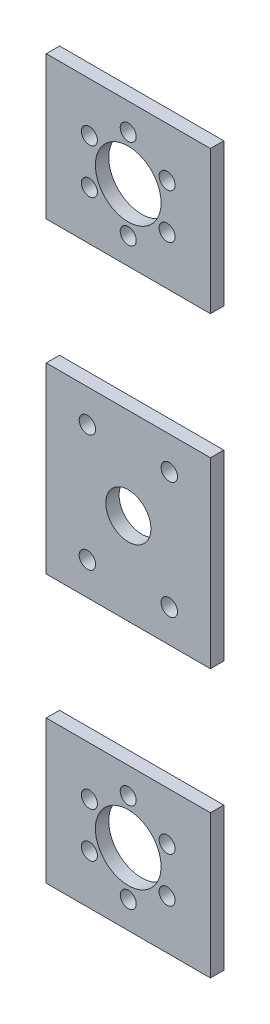
ISO-10303-21;
HEADER;
FILE_DESCRIPTION(('STEP AP214'),'2;1');
FILE_NAME('part.step','',(''),(''),'','','');
FILE_SCHEMA(('AUTOMOTIVE_DESIGN { 1 0 10303 214 1 1 1 1 }'));
ENDSEC;
DATA;
#1=APPLICATION_CONTEXT('core data for automotive mechanical design processes');
#2=APPLICATION_PROTOCOL_DEFINITION('international standard','automotive_design',2000,#1);
#3=PRODUCT_CONTEXT('',#1,'mechanical');
#4=PRODUCT('Part','Part','',(#3));
#5=PRODUCT_RELATED_PRODUCT_CATEGORY('part','',(#4));
#6=PRODUCT_DEFINITION_FORMATION('','',#4);
#7=PRODUCT_DEFINITION_CONTEXT('part definition',#1,'design');
#8=PRODUCT_DEFINITION('design','',#6,#7);
#9=PRODUCT_DEFINITION_SHAPE('','',#8);
#10=(LENGTH_UNIT() NAMED_UNIT(*) SI_UNIT(.MILLI.,.METRE.));
#11=(NAMED_UNIT(*) PLANE_ANGLE_UNIT() SI_UNIT($,.RADIAN.));
#12=(NAMED_UNIT(*) SI_UNIT($,.STERADIAN.) SOLID_ANGLE_UNIT());
#13=UNCERTAINTY_MEASURE_WITH_UNIT(LENGTH_MEASURE(1.E-05),#10,'distance_accuracy_value','');
#14=(GEOMETRIC_REPRESENTATION_CONTEXT(3) GLOBAL_UNCERTAINTY_ASSIGNED_CONTEXT((#13)) GLOBAL_UNIT_ASSIGNED_CONTEXT((#10,
#11,#12)) REPRESENTATION_CONTEXT('',''));
#15=CARTESIAN_POINT('',(0.,0.,0.));
#16=DIRECTION('',(0.,0.,1.));
#17=DIRECTION('',(1.,0.,0.));
#18=AXIS2_PLACEMENT_3D('',#15,#16,#17);
#19=CARTESIAN_POINT('',(40.,175.,6.5));
#20=DIRECTION('',(-1.,0.,0.));
#21=DIRECTION('',(0.,0.,1.));
#22=AXIS2_PLACEMENT_3D('',#19,#20,#21);
#23=PLANE('',#22);
#24=DIRECTION('',(0.,0.,1.));
#25=VECTOR('',#24,1.);
#26=CARTESIAN_POINT('',(40.,105.285938424401,6.5));
#27=LINE('',#26,#25);
#28=CARTESIAN_POINT('',(40.,105.285938424401,0.));
#29=VERTEX_POINT('',#28);
#30=CARTESIAN_POINT('',(40.,105.285938424401,6.5));
#31=VERTEX_POINT('',#30);
#32=EDGE_CURVE('E86',#29,#31,#27,.T.);
#33=ORIENTED_EDGE('',*,*,#32,.F.);
#34=DIRECTION('',(0.,1.,0.));
#35=VECTOR('',#34,1.);
#36=CARTESIAN_POINT('',(40.,175.,0.));
#37=LINE('',#36,#35);
#38=CARTESIAN_POINT('',(40.,175.,0.));
#39=VERTEX_POINT('',#38);
#40=EDGE_CURVE('E104',#29,#39,#37,.T.);
#41=ORIENTED_EDGE('',*,*,#40,.T.);
#42=DIRECTION('',(0.,0.,-1.));
#43=VECTOR('',#42,1.);
#44=CARTESIAN_POINT('',(40.,175.,6.5));
#45=LINE('',#44,#43);
#46=CARTESIAN_POINT('',(40.,175.,6.5));
#47=VERTEX_POINT('',#46);
#48=EDGE_CURVE('E115',#47,#39,#45,.T.);
#49=ORIENTED_EDGE('',*,*,#48,.F.);
#50=DIRECTION('',(0.,1.,0.));
#51=VECTOR('',#50,1.);
#52=CARTESIAN_POINT('',(40.,175.,6.5));
#53=LINE('',#52,#51);
#54=EDGE_CURVE('E108',#31,#47,#53,.T.);
#55=ORIENTED_EDGE('',*,*,#54,.F.);
#56=EDGE_LOOP('',(#33,#41,#49,#55));
#57=FACE_BOUND('',#56,.T.);
#58=ADVANCED_FACE('F61',(#57),#23,.F.);
#59=CARTESIAN_POINT('',(-40.,175.,6.5));
#60=DIRECTION('',(1.,0.,0.));
#61=DIRECTION('',(0.,1.,0.));
#62=AXIS2_PLACEMENT_3D('',#59,#60,#61);
#63=PLANE('',#62);
#64=DIRECTION('',(0.,0.,-1.));
#65=VECTOR('',#64,1.);
#66=CARTESIAN_POINT('',(-40.,105.285938424401,6.5));
#67=LINE('',#66,#65);
#68=CARTESIAN_POINT('',(-40.,105.285938424401,6.5));
#69=VERTEX_POINT('',#68);
#70=CARTESIAN_POINT('',(-40.,105.285938424401,0.));
#71=VERTEX_POINT('',#70);
#72=EDGE_CURVE('E70',#69,#71,#67,.T.);
#73=ORIENTED_EDGE('',*,*,#72,.F.);
#74=DIRECTION('',(0.,-1.,0.));
#75=VECTOR('',#74,1.);
#76=CARTESIAN_POINT('',(-40.,175.,6.5));
#77=LINE('',#76,#75);
#78=CARTESIAN_POINT('',(-40.,175.,6.5));
#79=VERTEX_POINT('',#78);
#80=EDGE_CURVE('E64',#79,#69,#77,.T.);
#81=ORIENTED_EDGE('',*,*,#80,.F.);
#82=DIRECTION('',(0.,0.,-1.));
#83=VECTOR('',#82,1.);
#84=CARTESIAN_POINT('',(-40.,175.,6.5));
#85=LINE('',#84,#83);
#86=CARTESIAN_POINT('',(-40.,175.,0.));
#87=VERTEX_POINT('',#86);
#88=EDGE_CURVE('E116',#79,#87,#85,.T.);
#89=ORIENTED_EDGE('',*,*,#88,.T.);
#90=DIRECTION('',(0.,-1.,0.));
#91=VECTOR('',#90,1.);
#92=CARTESIAN_POINT('',(-40.,175.,0.));
#93=LINE('',#92,#91);
#94=EDGE_CURVE('E128',#87,#71,#93,.T.);
#95=ORIENTED_EDGE('',*,*,#94,.T.);
#96=EDGE_LOOP('',(#73,#81,#89,#95));
#97=FACE_BOUND('',#96,.T.);
#98=ADVANCED_FACE('F174',(#97),#63,.F.);
#99=CARTESIAN_POINT('',(0.,0.,6.5));
#100=DIRECTION('',(0.,0.,1.));
#101=DIRECTION('',(1.,0.,0.));
#102=AXIS2_PLACEMENT_3D('',#99,#100,#101);
#103=PLANE('',#102);
#104=CARTESIAN_POINT('',(18.8924120266563,129.065015417287,6.5));
#105=DIRECTION('',(0.,0.,1.));
#106=DIRECTION('',(1.,0.,0.));
#107=AXIS2_PLACEMENT_3D('',#104,#105,#106);
#108=CIRCLE('',#107,3.90000000000003);
#109=CARTESIAN_POINT('',(22.7924120266564,129.065015417287,6.5));
#110=VERTEX_POINT('',#109);
#111=EDGE_CURVE('E145',#110,#110,#108,.T.);
#112=ORIENTED_EDGE('',*,*,#111,.F.);
#113=EDGE_LOOP('',(#112));
#114=FACE_BOUND('',#113,.T.);
#115=CARTESIAN_POINT('',(18.8924120266563,150.934984582713,6.5));
#116=DIRECTION('',(0.,0.,1.));
#117=DIRECTION('',(1.,0.,0.));
#118=AXIS2_PLACEMENT_3D('',#115,#116,#117);
#119=CIRCLE('',#118,3.89999999999999);
#120=CARTESIAN_POINT('',(22.7924120266563,150.934984582713,6.5));
#121=VERTEX_POINT('',#120);
#122=EDGE_CURVE('E148',#121,#121,#119,.T.);
#123=ORIENTED_EDGE('',*,*,#122,.F.);
#124=EDGE_LOOP('',(#123));
#125=FACE_BOUND('',#124,.T.);
#126=CARTESIAN_POINT('',(-0.0475368505847978,161.869969165426,6.5));
#127=DIRECTION('',(0.,0.,1.));
#128=DIRECTION('',(1.,0.,0.));
#129=AXIS2_PLACEMENT_3D('',#126,#127,#128);
#130=CIRCLE('',#129,3.89999999999999);
#131=CARTESIAN_POINT('',(3.8524631494152,161.869969165426,6.5));
#132=VERTEX_POINT('',#131);
#133=EDGE_CURVE('E154',#132,#132,#130,.T.);
#134=ORIENTED_EDGE('',*,*,#133,.F.);
#135=EDGE_LOOP('',(#134));
#136=FACE_BOUND('',#135,.T.);
#137=CARTESIAN_POINT('',(-18.9874857278259,150.934984582713,6.5));
#138=DIRECTION('',(0.,0.,1.));
#139=DIRECTION('',(1.,0.,0.));
#140=AXIS2_PLACEMENT_3D('',#137,#138,#139);
#141=CIRCLE('',#140,3.89999999999999);
#142=CARTESIAN_POINT('',(-15.0874857278259,150.934984582713,6.5));
#143=VERTEX_POINT('',#142);
#144=EDGE_CURVE('E133',#143,#143,#141,.T.);
#145=ORIENTED_EDGE('',*,*,#144,.F.);
#146=EDGE_LOOP('',(#145));
#147=FACE_BOUND('',#146,.T.);
#148=CARTESIAN_POINT('',(-0.0475368505847978,140.,6.5));
#149=DIRECTION('',(0.,0.,1.));
#150=DIRECTION('',(1.,0.,0.));
#151=AXIS2_PLACEMENT_3D('',#148,#149,#150);
#152=CIRCLE('',#151,16.);
#153=CARTESIAN_POINT('',(15.9524631494152,140.,6.5));
#154=VERTEX_POINT('',#153);
#155=EDGE_CURVE('E130',#154,#154,#152,.T.);
#156=ORIENTED_EDGE('',*,*,#155,.F.);
#157=EDGE_LOOP('',(#156));
#158=FACE_BOUND('',#157,.T.);
#159=CARTESIAN_POINT('',(-0.0475368505847978,118.130030834574,6.5));
#160=DIRECTION('',(0.,0.,1.));
#161=DIRECTION('',(1.,0.,0.));
#162=AXIS2_PLACEMENT_3D('',#159,#160,#161);
#163=CIRCLE('',#162,3.9);
#164=CARTESIAN_POINT('',(3.8524631494152,118.130030834574,6.5));
#165=VERTEX_POINT('',#164);
#166=EDGE_CURVE('E123',#165,#165,#163,.T.);
#167=ORIENTED_EDGE('',*,*,#166,.F.);
#168=EDGE_LOOP('',(#167));
#169=FACE_BOUND('',#168,.T.);
#170=CARTESIAN_POINT('',(-18.9874857278259,129.065015417287,6.5));
#171=DIRECTION('',(0.,0.,1.));
#172=DIRECTION('',(1.,0.,0.));
#173=AXIS2_PLACEMENT_3D('',#170,#171,#172);
#174=CIRCLE('',#173,3.89999999999999);
#175=CARTESIAN_POINT('',(-15.0874857278259,129.065015417287,6.5));
#176=VERTEX_POINT('',#175);
#177=EDGE_CURVE('E120',#176,#176,#174,.T.);
#178=ORIENTED_EDGE('',*,*,#177,.F.);
#179=EDGE_LOOP('',(#178));
#180=FACE_BOUND('',#179,.T.);
#181=ORIENTED_EDGE('',*,*,#80,.T.);
#182=DIRECTION('',(1.,0.,0.));
#183=VECTOR('',#182,1.);
#184=CARTESIAN_POINT('',(0.,105.285938424401,6.5));
#185=LINE('',#184,#183);
#186=EDGE_CURVE('E113',#69,#31,#185,.T.);
#187=ORIENTED_EDGE('',*,*,#186,.T.);
#188=ORIENTED_EDGE('',*,*,#54,.T.);
#189=DIRECTION('',(-1.,0.,0.));
#190=VECTOR('',#189,1.);
#191=CARTESIAN_POINT('',(-40.,175.,6.5));
#192=LINE('',#191,#190);
#193=EDGE_CURVE('E112',#47,#79,#192,.T.);
#194=ORIENTED_EDGE('',*,*,#193,.T.);
#195=EDGE_LOOP('',(#181,#187,#188,#194));
#196=FACE_BOUND('',#195,.T.);
#197=ADVANCED_FACE('F111',(#114,#125,#136,#147,#158,#169,#180,#196),#103,.T.);
#198=CARTESIAN_POINT('',(0.,0.,0.));
#199=DIRECTION('',(0.,0.,1.));
#200=DIRECTION('',(1.,0.,0.));
#201=AXIS2_PLACEMENT_3D('',#198,#199,#200);
#202=PLANE('',#201);
#203=CARTESIAN_POINT('',(-18.9874857278259,129.065015417287,0.));
#204=DIRECTION('',(0.,0.,1.));
#205=DIRECTION('',(1.,0.,0.));
#206=AXIS2_PLACEMENT_3D('',#203,#204,#205);
#207=CIRCLE('',#206,3.89999999999999);
#208=CARTESIAN_POINT('',(-15.0874857278259,129.065015417287,0.));
#209=VERTEX_POINT('',#208);
#210=EDGE_CURVE('E118',#209,#209,#207,.T.);
#211=ORIENTED_EDGE('',*,*,#210,.T.);
#212=EDGE_LOOP('',(#211));
#213=FACE_BOUND('',#212,.T.);
#214=CARTESIAN_POINT('',(-0.0475368505847978,118.130030834574,0.));
#215=DIRECTION('',(0.,0.,1.));
#216=DIRECTION('',(1.,0.,0.));
#217=AXIS2_PLACEMENT_3D('',#214,#215,#216);
#218=CIRCLE('',#217,3.9);
#219=CARTESIAN_POINT('',(3.8524631494152,118.130030834574,0.));
#220=VERTEX_POINT('',#219);
#221=EDGE_CURVE('E137',#220,#220,#218,.T.);
#222=ORIENTED_EDGE('',*,*,#221,.T.);
#223=EDGE_LOOP('',(#222));
#224=FACE_BOUND('',#223,.T.);
#225=CARTESIAN_POINT('',(-0.0475368505847978,140.,0.));
#226=DIRECTION('',(0.,0.,1.));
#227=DIRECTION('',(1.,0.,0.));
#228=AXIS2_PLACEMENT_3D('',#225,#226,#227);
#229=CIRCLE('',#228,16.);
#230=CARTESIAN_POINT('',(15.9524631494152,140.,0.));
#231=VERTEX_POINT('',#230);
#232=EDGE_CURVE('E134',#231,#231,#229,.T.);
#233=ORIENTED_EDGE('',*,*,#232,.T.);
#234=EDGE_LOOP('',(#233));
#235=FACE_BOUND('',#234,.T.);
#236=CARTESIAN_POINT('',(-18.9874857278259,150.934984582713,0.));
#237=DIRECTION('',(0.,0.,1.));
#238=DIRECTION('',(1.,0.,0.));
#239=AXIS2_PLACEMENT_3D('',#236,#237,#238);
#240=CIRCLE('',#239,3.89999999999999);
#241=CARTESIAN_POINT('',(-15.0874857278259,150.934984582713,0.));
#242=VERTEX_POINT('',#241);
#243=EDGE_CURVE('E136',#242,#242,#240,.T.);
#244=ORIENTED_EDGE('',*,*,#243,.T.);
#245=EDGE_LOOP('',(#244));
#246=FACE_BOUND('',#245,.T.);
#247=CARTESIAN_POINT('',(-0.0475368505847978,161.869969165426,0.));
#248=DIRECTION('',(0.,0.,1.));
#249=DIRECTION('',(1.,0.,0.));
#250=AXIS2_PLACEMENT_3D('',#247,#248,#249);
#251=CIRCLE('',#250,3.89999999999999);
#252=CARTESIAN_POINT('',(3.8524631494152,161.869969165426,0.));
#253=VERTEX_POINT('',#252);
#254=EDGE_CURVE('E157',#253,#253,#251,.T.);
#255=ORIENTED_EDGE('',*,*,#254,.T.);
#256=EDGE_LOOP('',(#255));
#257=FACE_BOUND('',#256,.T.);
#258=CARTESIAN_POINT('',(18.8924120266563,150.934984582713,0.));
#259=DIRECTION('',(0.,0.,1.));
#260=DIRECTION('',(1.,0.,0.));
#261=AXIS2_PLACEMENT_3D('',#258,#259,#260);
#262=CIRCLE('',#261,3.89999999999999);
#263=CARTESIAN_POINT('',(22.7924120266563,150.934984582713,0.));
#264=VERTEX_POINT('',#263);
#265=EDGE_CURVE('E151',#264,#264,#262,.T.);
#266=ORIENTED_EDGE('',*,*,#265,.T.);
#267=EDGE_LOOP('',(#266));
#268=FACE_BOUND('',#267,.T.);
#269=CARTESIAN_POINT('',(18.8924120266563,129.065015417287,0.));
#270=DIRECTION('',(0.,0.,1.));
#271=DIRECTION('',(1.,0.,0.));
#272=AXIS2_PLACEMENT_3D('',#269,#270,#271);
#273=CIRCLE('',#272,3.90000000000003);
#274=CARTESIAN_POINT('',(22.7924120266564,129.065015417287,0.));
#275=VERTEX_POINT('',#274);
#276=EDGE_CURVE('E125',#275,#275,#273,.T.);
#277=ORIENTED_EDGE('',*,*,#276,.T.);
#278=EDGE_LOOP('',(#277));
#279=FACE_BOUND('',#278,.T.);
#280=DIRECTION('',(1.,0.,0.));
#281=VECTOR('',#280,1.);
#282=CARTESIAN_POINT('',(0.,105.285938424401,0.));
#283=LINE('',#282,#281);
#284=EDGE_CURVE('E14',#71,#29,#283,.T.);
#285=ORIENTED_EDGE('',*,*,#284,.F.);
#286=ORIENTED_EDGE('',*,*,#94,.F.);
#287=DIRECTION('',(-1.,0.,0.));
#288=VECTOR('',#287,1.);
#289=CARTESIAN_POINT('',(-40.,175.,0.));
#290=LINE('',#289,#288);
#291=EDGE_CURVE('E95',#39,#87,#290,.T.);
#292=ORIENTED_EDGE('',*,*,#291,.F.);
#293=ORIENTED_EDGE('',*,*,#40,.F.);
#294=EDGE_LOOP('',(#285,#286,#292,#293));
#295=FACE_BOUND('',#294,.T.);
#296=ADVANCED_FACE('F177',(#213,#224,#235,#246,#257,#268,#279,#295),#202,.F.);
#297=CARTESIAN_POINT('',(-40.,175.,6.5));
#298=DIRECTION('',(0.,-1.,0.));
#299=DIRECTION('',(0.,0.,-1.));
#300=AXIS2_PLACEMENT_3D('',#297,#298,#299);
#301=PLANE('',#300);
#302=ORIENTED_EDGE('',*,*,#291,.T.);
#303=ORIENTED_EDGE('',*,*,#88,.F.);
#304=ORIENTED_EDGE('',*,*,#193,.F.);
#305=ORIENTED_EDGE('',*,*,#48,.T.);
#306=EDGE_LOOP('',(#302,#303,#304,#305));
#307=FACE_BOUND('',#306,.T.);
#308=ADVANCED_FACE('F114',(#307),#301,.F.);
#309=CARTESIAN_POINT('',(-18.9874857278259,129.065015417287,0.));
#310=DIRECTION('',(0.,0.,1.));
#311=DIRECTION('',(1.,0.,0.));
#312=AXIS2_PLACEMENT_3D('',#309,#310,#311);
#313=CYLINDRICAL_SURFACE('',#312,3.89999999999999);
#314=ORIENTED_EDGE('',*,*,#210,.F.);
#315=EDGE_LOOP('',(#314));
#316=FACE_BOUND('',#315,.T.);
#317=ORIENTED_EDGE('',*,*,#177,.T.);
#318=EDGE_LOOP('',(#317));
#319=FACE_BOUND('',#318,.T.);
#320=ADVANCED_FACE('F185',(#316,#319),#313,.F.);
#321=CARTESIAN_POINT('',(-0.0475368505847978,118.130030834574,0.));
#322=DIRECTION('',(0.,0.,1.));
#323=DIRECTION('',(1.,0.,0.));
#324=AXIS2_PLACEMENT_3D('',#321,#322,#323);
#325=CYLINDRICAL_SURFACE('',#324,3.9);
#326=ORIENTED_EDGE('',*,*,#221,.F.);
#327=EDGE_LOOP('',(#326));
#328=FACE_BOUND('',#327,.T.);
#329=ORIENTED_EDGE('',*,*,#166,.T.);
#330=EDGE_LOOP('',(#329));
#331=FACE_BOUND('',#330,.T.);
#332=ADVANCED_FACE('F220',(#328,#331),#325,.F.);
#333=CARTESIAN_POINT('',(-0.0475368505847978,140.,0.));
#334=DIRECTION('',(0.,0.,1.));
#335=DIRECTION('',(1.,0.,0.));
#336=AXIS2_PLACEMENT_3D('',#333,#334,#335);
#337=CYLINDRICAL_SURFACE('',#336,16.);
#338=ORIENTED_EDGE('',*,*,#232,.F.);
#339=EDGE_LOOP('',(#338));
#340=FACE_BOUND('',#339,.T.);
#341=ORIENTED_EDGE('',*,*,#155,.T.);
#342=EDGE_LOOP('',(#341));
#343=FACE_BOUND('',#342,.T.);
#344=ADVANCED_FACE('F230',(#340,#343),#337,.F.);
#345=CARTESIAN_POINT('',(-18.9874857278259,150.934984582713,0.));
#346=DIRECTION('',(0.,0.,1.));
#347=DIRECTION('',(1.,0.,0.));
#348=AXIS2_PLACEMENT_3D('',#345,#346,#347);
#349=CYLINDRICAL_SURFACE('',#348,3.89999999999999);
#350=ORIENTED_EDGE('',*,*,#243,.F.);
#351=EDGE_LOOP('',(#350));
#352=FACE_BOUND('',#351,.T.);
#353=ORIENTED_EDGE('',*,*,#144,.T.);
#354=EDGE_LOOP('',(#353));
#355=FACE_BOUND('',#354,.T.);
#356=ADVANCED_FACE('F240',(#352,#355),#349,.F.);
#357=CARTESIAN_POINT('',(-0.0475368505847978,161.869969165426,0.));
#358=DIRECTION('',(0.,0.,1.));
#359=DIRECTION('',(1.,0.,0.));
#360=AXIS2_PLACEMENT_3D('',#357,#358,#359);
#361=CYLINDRICAL_SURFACE('',#360,3.89999999999999);
#362=ORIENTED_EDGE('',*,*,#254,.F.);
#363=EDGE_LOOP('',(#362));
#364=FACE_BOUND('',#363,.T.);
#365=ORIENTED_EDGE('',*,*,#133,.T.);
#366=EDGE_LOOP('',(#365));
#367=FACE_BOUND('',#366,.T.);
#368=ADVANCED_FACE('F250',(#364,#367),#361,.F.);
#369=CARTESIAN_POINT('',(18.8924120266563,150.934984582713,0.));
#370=DIRECTION('',(0.,0.,1.));
#371=DIRECTION('',(1.,0.,0.));
#372=AXIS2_PLACEMENT_3D('',#369,#370,#371);
#373=CYLINDRICAL_SURFACE('',#372,3.89999999999999);
#374=ORIENTED_EDGE('',*,*,#265,.F.);
#375=EDGE_LOOP('',(#374));
#376=FACE_BOUND('',#375,.T.);
#377=ORIENTED_EDGE('',*,*,#122,.T.);
#378=EDGE_LOOP('',(#377));
#379=FACE_BOUND('',#378,.T.);
#380=ADVANCED_FACE('F260',(#376,#379),#373,.F.);
#381=CARTESIAN_POINT('',(18.8924120266563,129.065015417287,0.));
#382=DIRECTION('',(0.,0.,1.));
#383=DIRECTION('',(1.,0.,0.));
#384=AXIS2_PLACEMENT_3D('',#381,#382,#383);
#385=CYLINDRICAL_SURFACE('',#384,3.90000000000003);
#386=ORIENTED_EDGE('',*,*,#276,.F.);
#387=EDGE_LOOP('',(#386));
#388=FACE_BOUND('',#387,.T.);
#389=ORIENTED_EDGE('',*,*,#111,.T.);
#390=EDGE_LOOP('',(#389));
#391=FACE_BOUND('',#390,.T.);
#392=ADVANCED_FACE('F270',(#388,#391),#385,.F.);
#393=CARTESIAN_POINT('',(0.,105.285938424401,0.));
#394=DIRECTION('',(0.,-1.,0.));
#395=DIRECTION('',(0.,0.,-1.));
#396=AXIS2_PLACEMENT_3D('',#393,#394,#395);
#397=PLANE('',#396);
#398=ORIENTED_EDGE('',*,*,#32,.T.);
#399=ORIENTED_EDGE('',*,*,#186,.F.);
#400=ORIENTED_EDGE('',*,*,#72,.T.);
#401=ORIENTED_EDGE('',*,*,#284,.T.);
#402=EDGE_LOOP('',(#398,#399,#400,#401));
#403=FACE_BOUND('',#402,.T.);
#404=ADVANCED_FACE('F175',(#403),#397,.T.);
#405=CLOSED_SHELL('',(#58,#98,#197,#296,#308,#320,#332,#344,#356,#368,#380,#392,#404));
#406=MANIFOLD_SOLID_BREP('B2',#405);
#407=CARTESIAN_POINT('',(-40.,-175.,6.5));
#408=DIRECTION('',(0.,1.,0.));
#409=DIRECTION('',(0.,0.,1.));
#410=AXIS2_PLACEMENT_3D('',#407,#408,#409);
#411=PLANE('',#410);
#412=DIRECTION('',(1.,0.,0.));
#413=VECTOR('',#412,1.);
#414=CARTESIAN_POINT('',(-40.,-175.,0.));
#415=LINE('',#414,#413);
#416=CARTESIAN_POINT('',(-40.,-175.,0.));
#417=VERTEX_POINT('',#416);
#418=CARTESIAN_POINT('',(40.,-175.,0.));
#419=VERTEX_POINT('',#418);
#420=EDGE_CURVE('E411',#417,#419,#415,.T.);
#421=ORIENTED_EDGE('',*,*,#420,.T.);
#422=DIRECTION('',(0.,0.,-1.));
#423=VECTOR('',#422,1.);
#424=CARTESIAN_POINT('',(40.,-175.,6.5));
#425=LINE('',#424,#423);
#426=CARTESIAN_POINT('',(40.,-175.,6.5));
#427=VERTEX_POINT('',#426);
#428=EDGE_CURVE('E352',#427,#419,#425,.T.);
#429=ORIENTED_EDGE('',*,*,#428,.F.);
#430=DIRECTION('',(1.,0.,0.));
#431=VECTOR('',#430,1.);
#432=CARTESIAN_POINT('',(-40.,-175.,6.5));
#433=LINE('',#432,#431);
#434=CARTESIAN_POINT('',(-40.,-175.,6.5));
#435=VERTEX_POINT('',#434);
#436=EDGE_CURVE('E398',#435,#427,#433,.T.);
#437=ORIENTED_EDGE('',*,*,#436,.F.);
#438=DIRECTION('',(0.,0.,-1.));
#439=VECTOR('',#438,1.);
#440=CARTESIAN_POINT('',(-40.,-175.,6.5));
#441=LINE('',#440,#439);
#442=EDGE_CURVE('E396',#435,#417,#441,.T.);
#443=ORIENTED_EDGE('',*,*,#442,.T.);
#444=EDGE_LOOP('',(#421,#429,#437,#443));
#445=FACE_BOUND('',#444,.T.);
#446=ADVANCED_FACE('F342',(#445),#411,.F.);
#447=CARTESIAN_POINT('',(-18.9874857278259,-150.934984582713,0.));
#448=DIRECTION('',(0.,0.,1.));
#449=DIRECTION('',(1.,0.,0.));
#450=AXIS2_PLACEMENT_3D('',#447,#448,#449);
#451=CYLINDRICAL_SURFACE('',#450,3.89999999999999);
#452=CARTESIAN_POINT('',(-18.9874857278259,-150.934984582713,0.));
#453=DIRECTION('',(0.,0.,1.));
#454=DIRECTION('',(-1.,0.,0.));
#455=AXIS2_PLACEMENT_3D('',#452,#453,#454);
#456=CIRCLE('',#455,3.89999999999999);
#457=CARTESIAN_POINT('',(-22.8874857278259,-150.934984582713,0.));
#458=VERTEX_POINT('',#457);
#459=EDGE_CURVE('E400',#458,#458,#456,.T.);
#460=ORIENTED_EDGE('',*,*,#459,.F.);
#461=EDGE_LOOP('',(#460));
#462=FACE_BOUND('',#461,.T.);
#463=CARTESIAN_POINT('',(-18.9874857278259,-150.934984582713,6.5));
#464=DIRECTION('',(0.,0.,1.));
#465=DIRECTION('',(-1.,0.,0.));
#466=AXIS2_PLACEMENT_3D('',#463,#464,#465);
#467=CIRCLE('',#466,3.89999999999999);
#468=CARTESIAN_POINT('',(-22.8874857278259,-150.934984582713,6.5));
#469=VERTEX_POINT('',#468);
#470=EDGE_CURVE('E410',#469,#469,#467,.T.);
#471=ORIENTED_EDGE('',*,*,#470,.T.);
#472=EDGE_LOOP('',(#471));
#473=FACE_BOUND('',#472,.T.);
#474=ADVANCED_FACE('F467',(#462,#473),#451,.F.);
#475=CARTESIAN_POINT('',(-0.0475368505847978,-161.869969165426,0.));
#476=DIRECTION('',(0.,0.,1.));
#477=DIRECTION('',(1.,0.,0.));
#478=AXIS2_PLACEMENT_3D('',#475,#476,#477);
#479=CYLINDRICAL_SURFACE('',#478,3.89999999999999);
#480=CARTESIAN_POINT('',(-0.0475368505847978,-161.869969165426,0.));
#481=DIRECTION('',(0.,0.,1.));
#482=DIRECTION('',(-1.,0.,0.));
#483=AXIS2_PLACEMENT_3D('',#480,#481,#482);
#484=CIRCLE('',#483,3.89999999999999);
#485=CARTESIAN_POINT('',(-3.94753685058479,-161.869969165426,0.));
#486=VERTEX_POINT('',#485);
#487=EDGE_CURVE('E406',#486,#486,#484,.T.);
#488=ORIENTED_EDGE('',*,*,#487,.F.);
#489=EDGE_LOOP('',(#488));
#490=FACE_BOUND('',#489,.T.);
#491=CARTESIAN_POINT('',(-0.0475368505847978,-161.869969165426,6.5));
#492=DIRECTION('',(0.,0.,1.));
#493=DIRECTION('',(-1.,0.,0.));
#494=AXIS2_PLACEMENT_3D('',#491,#492,#493);
#495=CIRCLE('',#494,3.89999999999999);
#496=CARTESIAN_POINT('',(-3.94753685058479,-161.869969165426,6.5));
#497=VERTEX_POINT('',#496);
#498=EDGE_CURVE('E419',#497,#497,#495,.T.);
#499=ORIENTED_EDGE('',*,*,#498,.T.);
#500=EDGE_LOOP('',(#499));
#501=FACE_BOUND('',#500,.T.);
#502=ADVANCED_FACE('F472',(#490,#501),#479,.F.);
#503=CARTESIAN_POINT('',(-0.0475368505847978,-140.,0.));
#504=DIRECTION('',(0.,0.,1.));
#505=DIRECTION('',(1.,0.,0.));
#506=AXIS2_PLACEMENT_3D('',#503,#504,#505);
#507=CYLINDRICAL_SURFACE('',#506,16.);
#508=CARTESIAN_POINT('',(-0.0475368505847978,-140.,0.));
#509=DIRECTION('',(0.,0.,1.));
#510=DIRECTION('',(-1.,0.,0.));
#511=AXIS2_PLACEMENT_3D('',#508,#509,#510);
#512=CIRCLE('',#511,16.);
#513=CARTESIAN_POINT('',(-16.0475368505848,-140.,0.));
#514=VERTEX_POINT('',#513);
#515=EDGE_CURVE('E420',#514,#514,#512,.T.);
#516=ORIENTED_EDGE('',*,*,#515,.F.);
#517=EDGE_LOOP('',(#516));
#518=FACE_BOUND('',#517,.T.);
#519=CARTESIAN_POINT('',(-0.0475368505847978,-140.,6.5));
#520=DIRECTION('',(0.,0.,1.));
#521=DIRECTION('',(-1.,0.,0.));
#522=AXIS2_PLACEMENT_3D('',#519,#520,#521);
#523=CIRCLE('',#522,16.);
#524=CARTESIAN_POINT('',(-16.0475368505848,-140.,6.5));
#525=VERTEX_POINT('',#524);
#526=EDGE_CURVE('E415',#525,#525,#523,.T.);
#527=ORIENTED_EDGE('',*,*,#526,.T.);
#528=EDGE_LOOP('',(#527));
#529=FACE_BOUND('',#528,.T.);
#530=ADVANCED_FACE('F476',(#518,#529),#507,.F.);
#531=CARTESIAN_POINT('',(18.8924120266563,-129.065015417287,0.));
#532=DIRECTION('',(0.,0.,1.));
#533=DIRECTION('',(1.,0.,0.));
#534=AXIS2_PLACEMENT_3D('',#531,#532,#533);
#535=CYLINDRICAL_SURFACE('',#534,3.90000000000003);
#536=CARTESIAN_POINT('',(18.8924120266563,-129.065015417287,0.));
#537=DIRECTION('',(0.,0.,1.));
#538=DIRECTION('',(-1.,0.,0.));
#539=AXIS2_PLACEMENT_3D('',#536,#537,#538);
#540=CIRCLE('',#539,3.90000000000003);
#541=CARTESIAN_POINT('',(14.9924120266563,-129.065015417287,0.));
#542=VERTEX_POINT('',#541);
#543=EDGE_CURVE('E423',#542,#542,#540,.T.);
#544=ORIENTED_EDGE('',*,*,#543,.F.);
#545=EDGE_LOOP('',(#544));
#546=FACE_BOUND('',#545,.T.);
#547=CARTESIAN_POINT('',(18.8924120266563,-129.065015417287,6.5));
#548=DIRECTION('',(0.,0.,1.));
#549=DIRECTION('',(-1.,0.,0.));
#550=AXIS2_PLACEMENT_3D('',#547,#548,#549);
#551=CIRCLE('',#550,3.90000000000003);
#552=CARTESIAN_POINT('',(14.9924120266563,-129.065015417287,6.5));
#553=VERTEX_POINT('',#552);
#554=EDGE_CURVE('E418',#553,#553,#551,.T.);
#555=ORIENTED_EDGE('',*,*,#554,.T.);
#556=EDGE_LOOP('',(#555));
#557=FACE_BOUND('',#556,.T.);
#558=ADVANCED_FACE('F479',(#546,#557),#535,.F.);
#559=CARTESIAN_POINT('',(18.8924120266563,-150.934984582713,0.));
#560=DIRECTION('',(0.,0.,1.));
#561=DIRECTION('',(1.,0.,0.));
#562=AXIS2_PLACEMENT_3D('',#559,#560,#561);
#563=CYLINDRICAL_SURFACE('',#562,3.89999999999999);
#564=CARTESIAN_POINT('',(18.8924120266563,-150.934984582713,0.));
#565=DIRECTION('',(0.,0.,1.));
#566=DIRECTION('',(-1.,0.,0.));
#567=AXIS2_PLACEMENT_3D('',#564,#565,#566);
#568=CIRCLE('',#567,3.89999999999999);
#569=CARTESIAN_POINT('',(14.9924120266563,-150.934984582713,0.));
#570=VERTEX_POINT('',#569);
#571=EDGE_CURVE('E428',#570,#570,#568,.T.);
#572=ORIENTED_EDGE('',*,*,#571,.F.);
#573=EDGE_LOOP('',(#572));
#574=FACE_BOUND('',#573,.T.);
#575=CARTESIAN_POINT('',(18.8924120266563,-150.934984582713,6.5));
#576=DIRECTION('',(0.,0.,1.));
#577=DIRECTION('',(-1.,0.,0.));
#578=AXIS2_PLACEMENT_3D('',#575,#576,#577);
#579=CIRCLE('',#578,3.89999999999999);
#580=CARTESIAN_POINT('',(14.9924120266563,-150.934984582713,6.5));
#581=VERTEX_POINT('',#580);
#582=EDGE_CURVE('E424',#581,#581,#579,.T.);
#583=ORIENTED_EDGE('',*,*,#582,.T.);
#584=EDGE_LOOP('',(#583));
#585=FACE_BOUND('',#584,.T.);
#586=ADVANCED_FACE('F481',(#574,#585),#563,.F.);
#587=CARTESIAN_POINT('',(-18.9874857278259,-129.065015417287,0.));
#588=DIRECTION('',(0.,0.,1.));
#589=DIRECTION('',(1.,0.,0.));
#590=AXIS2_PLACEMENT_3D('',#587,#588,#589);
#591=CYLINDRICAL_SURFACE('',#590,3.89999999999999);
#592=CARTESIAN_POINT('',(-18.9874857278259,-129.065015417287,0.));
#593=DIRECTION('',(0.,0.,1.));
#594=DIRECTION('',(-1.,0.,0.));
#595=AXIS2_PLACEMENT_3D('',#592,#593,#594);
#596=CIRCLE('',#595,3.89999999999999);
#597=CARTESIAN_POINT('',(-22.8874857278259,-129.065015417287,0.));
#598=VERTEX_POINT('',#597);
#599=EDGE_CURVE('E431',#598,#598,#596,.T.);
#600=ORIENTED_EDGE('',*,*,#599,.F.);
#601=EDGE_LOOP('',(#600));
#602=FACE_BOUND('',#601,.T.);
#603=CARTESIAN_POINT('',(-18.9874857278259,-129.065015417287,6.5));
#604=DIRECTION('',(0.,0.,1.));
#605=DIRECTION('',(-1.,0.,0.));
#606=AXIS2_PLACEMENT_3D('',#603,#604,#605);
#607=CIRCLE('',#606,3.89999999999999);
#608=CARTESIAN_POINT('',(-22.8874857278259,-129.065015417287,6.5));
#609=VERTEX_POINT('',#608);
#610=EDGE_CURVE('E427',#609,#609,#607,.T.);
#611=ORIENTED_EDGE('',*,*,#610,.T.);
#612=EDGE_LOOP('',(#611));
#613=FACE_BOUND('',#612,.T.);
#614=ADVANCED_FACE('F484',(#602,#613),#591,.F.);
#615=CARTESIAN_POINT('',(-0.0475368505847978,-118.130030834574,0.));
#616=DIRECTION('',(0.,0.,1.));
#617=DIRECTION('',(1.,0.,0.));
#618=AXIS2_PLACEMENT_3D('',#615,#616,#617);
#619=CYLINDRICAL_SURFACE('',#618,3.9);
#620=CARTESIAN_POINT('',(-0.0475368505847978,-118.130030834574,0.));
#621=DIRECTION('',(0.,0.,1.));
#622=DIRECTION('',(-1.,0.,0.));
#623=AXIS2_PLACEMENT_3D('',#620,#621,#622);
#624=CIRCLE('',#623,3.9);
#625=CARTESIAN_POINT('',(-3.9475368505848,-118.130030834574,0.));
#626=VERTEX_POINT('',#625);
#627=EDGE_CURVE('E445',#626,#626,#624,.T.);
#628=ORIENTED_EDGE('',*,*,#627,.F.);
#629=EDGE_LOOP('',(#628));
#630=FACE_BOUND('',#629,.T.);
#631=CARTESIAN_POINT('',(-0.0475368505847978,-118.130030834574,6.5));
#632=DIRECTION('',(0.,0.,1.));
#633=DIRECTION('',(-1.,0.,0.));
#634=AXIS2_PLACEMENT_3D('',#631,#632,#633);
#635=CIRCLE('',#634,3.9);
#636=CARTESIAN_POINT('',(-3.9475368505848,-118.130030834574,6.5));
#637=VERTEX_POINT('',#636);
#638=EDGE_CURVE('E442',#637,#637,#635,.T.);
#639=ORIENTED_EDGE('',*,*,#638,.T.);
#640=EDGE_LOOP('',(#639));
#641=FACE_BOUND('',#640,.T.);
#642=ADVANCED_FACE('F492',(#630,#641),#619,.F.);
#643=CARTESIAN_POINT('',(0.,0.,0.));
#644=DIRECTION('',(0.,0.,1.));
#645=DIRECTION('',(1.,0.,0.));
#646=AXIS2_PLACEMENT_3D('',#643,#644,#645);
#647=PLANE('',#646);
#648=ORIENTED_EDGE('',*,*,#627,.T.);
#649=EDGE_LOOP('',(#648));
#650=FACE_BOUND('',#649,.T.);
#651=ORIENTED_EDGE('',*,*,#599,.T.);
#652=EDGE_LOOP('',(#651));
#653=FACE_BOUND('',#652,.T.);
#654=ORIENTED_EDGE('',*,*,#571,.T.);
#655=EDGE_LOOP('',(#654));
#656=FACE_BOUND('',#655,.T.);
#657=ORIENTED_EDGE('',*,*,#543,.T.);
#658=EDGE_LOOP('',(#657));
#659=FACE_BOUND('',#658,.T.);
#660=ORIENTED_EDGE('',*,*,#515,.T.);
#661=EDGE_LOOP('',(#660));
#662=FACE_BOUND('',#661,.T.);
#663=ORIENTED_EDGE('',*,*,#487,.T.);
#664=EDGE_LOOP('',(#663));
#665=FACE_BOUND('',#664,.T.);
#666=ORIENTED_EDGE('',*,*,#459,.T.);
#667=EDGE_LOOP('',(#666));
#668=FACE_BOUND('',#667,.T.);
#669=DIRECTION('',(0.,-1.,0.));
#670=VECTOR('',#669,1.);
#671=CARTESIAN_POINT('',(-40.,175.,0.));
#672=LINE('',#671,#670);
#673=CARTESIAN_POINT('',(-40.,-105.285938424401,0.));
#674=VERTEX_POINT('',#673);
#675=EDGE_CURVE('E385',#674,#417,#672,.T.);
#676=ORIENTED_EDGE('',*,*,#675,.F.);
#677=DIRECTION('',(1.,0.,0.));
#678=VECTOR('',#677,1.);
#679=CARTESIAN_POINT('',(0.,-105.285938424401,0.));
#680=LINE('',#679,#678);
#681=CARTESIAN_POINT('',(40.,-105.285938424401,0.));
#682=VERTEX_POINT('',#681);
#683=EDGE_CURVE('E377',#674,#682,#680,.T.);
#684=ORIENTED_EDGE('',*,*,#683,.T.);
#685=DIRECTION('',(0.,1.,0.));
#686=VECTOR('',#685,1.);
#687=CARTESIAN_POINT('',(40.,175.,0.));
#688=LINE('',#687,#686);
#689=EDGE_CURVE('E452',#419,#682,#688,.T.);
#690=ORIENTED_EDGE('',*,*,#689,.F.);
#691=ORIENTED_EDGE('',*,*,#420,.F.);
#692=EDGE_LOOP('',(#676,#684,#690,#691));
#693=FACE_BOUND('',#692,.T.);
#694=ADVANCED_FACE('F458',(#650,#653,#656,#659,#662,#665,#668,#693),#647,.F.);
#695=CARTESIAN_POINT('',(0.,0.,6.5));
#696=DIRECTION('',(0.,0.,1.));
#697=DIRECTION('',(1.,0.,0.));
#698=AXIS2_PLACEMENT_3D('',#695,#696,#697);
#699=PLANE('',#698);
#700=DIRECTION('',(1.,0.,0.));
#701=VECTOR('',#700,1.);
#702=CARTESIAN_POINT('',(0.,-105.285938424401,6.5));
#703=LINE('',#702,#701);
#704=CARTESIAN_POINT('',(-40.,-105.285938424401,6.5));
#705=VERTEX_POINT('',#704);
#706=CARTESIAN_POINT('',(40.,-105.285938424401,6.5));
#707=VERTEX_POINT('',#706);
#708=EDGE_CURVE('E59',#705,#707,#703,.T.);
#709=ORIENTED_EDGE('',*,*,#708,.F.);
#710=DIRECTION('',(0.,-1.,0.));
#711=VECTOR('',#710,1.);
#712=CARTESIAN_POINT('',(-40.,175.,6.5));
#713=LINE('',#712,#711);
#714=EDGE_CURVE('E346',#705,#435,#713,.T.);
#715=ORIENTED_EDGE('',*,*,#714,.T.);
#716=ORIENTED_EDGE('',*,*,#436,.T.);
#717=DIRECTION('',(0.,1.,0.));
#718=VECTOR('',#717,1.);
#719=CARTESIAN_POINT('',(40.,175.,6.5));
#720=LINE('',#719,#718);
#721=EDGE_CURVE('E386',#427,#707,#720,.T.);
#722=ORIENTED_EDGE('',*,*,#721,.T.);
#723=EDGE_LOOP('',(#709,#715,#716,#722));
#724=FACE_BOUND('',#723,.T.);
#725=ORIENTED_EDGE('',*,*,#638,.F.);
#726=EDGE_LOOP('',(#725));
#727=FACE_BOUND('',#726,.T.);
#728=ORIENTED_EDGE('',*,*,#610,.F.);
#729=EDGE_LOOP('',(#728));
#730=FACE_BOUND('',#729,.T.);
#731=ORIENTED_EDGE('',*,*,#582,.F.);
#732=EDGE_LOOP('',(#731));
#733=FACE_BOUND('',#732,.T.);
#734=ORIENTED_EDGE('',*,*,#554,.F.);
#735=EDGE_LOOP('',(#734));
#736=FACE_BOUND('',#735,.T.);
#737=ORIENTED_EDGE('',*,*,#526,.F.);
#738=EDGE_LOOP('',(#737));
#739=FACE_BOUND('',#738,.T.);
#740=ORIENTED_EDGE('',*,*,#498,.F.);
#741=EDGE_LOOP('',(#740));
#742=FACE_BOUND('',#741,.T.);
#743=ORIENTED_EDGE('',*,*,#470,.F.);
#744=EDGE_LOOP('',(#743));
#745=FACE_BOUND('',#744,.T.);
#746=ADVANCED_FACE('F390',(#724,#727,#730,#733,#736,#739,#742,#745),#699,.T.);
#747=CARTESIAN_POINT('',(-40.,175.,6.5));
#748=DIRECTION('',(1.,0.,0.));
#749=DIRECTION('',(0.,1.,0.));
#750=AXIS2_PLACEMENT_3D('',#747,#748,#749);
#751=PLANE('',#750);
#752=ORIENTED_EDGE('',*,*,#714,.F.);
#753=DIRECTION('',(0.,0.,-1.));
#754=VECTOR('',#753,1.);
#755=CARTESIAN_POINT('',(-40.,-105.285938424401,6.5));
#756=LINE('',#755,#754);
#757=EDGE_CURVE('E379',#705,#674,#756,.T.);
#758=ORIENTED_EDGE('',*,*,#757,.T.);
#759=ORIENTED_EDGE('',*,*,#675,.T.);
#760=ORIENTED_EDGE('',*,*,#442,.F.);
#761=EDGE_LOOP('',(#752,#758,#759,#760));
#762=FACE_BOUND('',#761,.T.);
#763=ADVANCED_FACE('F394',(#762),#751,.F.);
#764=CARTESIAN_POINT('',(40.,175.,6.5));
#765=DIRECTION('',(-1.,0.,0.));
#766=DIRECTION('',(0.,0.,1.));
#767=AXIS2_PLACEMENT_3D('',#764,#765,#766);
#768=PLANE('',#767);
#769=ORIENTED_EDGE('',*,*,#689,.T.);
#770=DIRECTION('',(0.,0.,1.));
#771=VECTOR('',#770,1.);
#772=CARTESIAN_POINT('',(40.,-105.285938424401,6.5));
#773=LINE('',#772,#771);
#774=EDGE_CURVE('E360',#682,#707,#773,.T.);
#775=ORIENTED_EDGE('',*,*,#774,.T.);
#776=ORIENTED_EDGE('',*,*,#721,.F.);
#777=ORIENTED_EDGE('',*,*,#428,.T.);
#778=EDGE_LOOP('',(#769,#775,#776,#777));
#779=FACE_BOUND('',#778,.T.);
#780=ADVANCED_FACE('F344',(#779),#768,.F.);
#781=CARTESIAN_POINT('',(0.,-105.285938424401,0.));
#782=DIRECTION('',(0.,-1.,0.));
#783=DIRECTION('',(0.,0.,-1.));
#784=AXIS2_PLACEMENT_3D('',#781,#782,#783);
#785=PLANE('',#784);
#786=ORIENTED_EDGE('',*,*,#683,.F.);
#787=ORIENTED_EDGE('',*,*,#757,.F.);
#788=ORIENTED_EDGE('',*,*,#708,.T.);
#789=ORIENTED_EDGE('',*,*,#774,.F.);
#790=EDGE_LOOP('',(#786,#787,#788,#789));
#791=FACE_BOUND('',#790,.T.);
#792=ADVANCED_FACE('F381',(#791),#785,.F.);
#793=CLOSED_SHELL('',(#446,#474,#502,#530,#558,#586,#614,#642,#694,#746,#763,#780,#792));
#794=MANIFOLD_SOLID_BREP('B8',#793);
#795=CARTESIAN_POINT('',(0.,0.,0.));
#796=DIRECTION('',(0.,0.,1.));
#797=DIRECTION('',(1.,0.,0.));
#798=AXIS2_PLACEMENT_3D('',#795,#796,#797);
#799=CYLINDRICAL_SURFACE('',#798,11.);
#800=CARTESIAN_POINT('',(0.,0.,0.));
#801=DIRECTION('',(0.,0.,1.));
#802=DIRECTION('',(1.,0.,0.));
#803=AXIS2_PLACEMENT_3D('',#800,#801,#802);
#804=CIRCLE('',#803,11.);
#805=CARTESIAN_POINT('',(11.,0.,0.));
#806=VERTEX_POINT('',#805);
#807=EDGE_CURVE('E686',#806,#806,#804,.T.);
#808=ORIENTED_EDGE('',*,*,#807,.F.);
#809=EDGE_LOOP('',(#808));
#810=FACE_BOUND('',#809,.T.);
#811=CARTESIAN_POINT('',(0.,0.,6.5));
#812=DIRECTION('',(0.,0.,1.));
#813=DIRECTION('',(1.,0.,0.));
#814=AXIS2_PLACEMENT_3D('',#811,#812,#813);
#815=CIRCLE('',#814,11.);
#816=CARTESIAN_POINT('',(11.,0.,6.5));
#817=VERTEX_POINT('',#816);
#818=EDGE_CURVE('E690',#817,#817,#815,.T.);
#819=ORIENTED_EDGE('',*,*,#818,.T.);
#820=EDGE_LOOP('',(#819));
#821=FACE_BOUND('',#820,.T.);
#822=ADVANCED_FACE('F618',(#810,#821),#799,.F.);
#823=CARTESIAN_POINT('',(-19.9502601866195,-28.5120903551883,0.));
#824=DIRECTION('',(0.,0.,1.));
#825=DIRECTION('',(1.,0.,0.));
#826=AXIS2_PLACEMENT_3D('',#823,#824,#825);
#827=CYLINDRICAL_SURFACE('',#826,4.);
#828=CARTESIAN_POINT('',(-19.9502601866195,-28.5120903551883,0.));
#829=DIRECTION('',(0.,0.,1.));
#830=DIRECTION('',(1.,0.,0.));
#831=AXIS2_PLACEMENT_3D('',#828,#829,#830);
#832=CIRCLE('',#831,4.);
#833=CARTESIAN_POINT('',(-15.9502601866195,-28.5120903551883,0.));
#834=VERTEX_POINT('',#833);
#835=EDGE_CURVE('E712',#834,#834,#832,.T.);
#836=ORIENTED_EDGE('',*,*,#835,.F.);
#837=EDGE_LOOP('',(#836));
#838=FACE_BOUND('',#837,.T.);
#839=CARTESIAN_POINT('',(-19.9502601866195,-28.5120903551883,6.5));
#840=DIRECTION('',(0.,0.,1.));
#841=DIRECTION('',(1.,0.,0.));
#842=AXIS2_PLACEMENT_3D('',#839,#840,#841);
#843=CIRCLE('',#842,4.);
#844=CARTESIAN_POINT('',(-15.9502601866195,-28.5120903551883,6.5));
#845=VERTEX_POINT('',#844);
#846=EDGE_CURVE('E709',#845,#845,#843,.T.);
#847=ORIENTED_EDGE('',*,*,#846,.T.);
#848=EDGE_LOOP('',(#847));
#849=FACE_BOUND('',#848,.T.);
#850=ADVANCED_FACE('F741',(#838,#849),#827,.F.);
#851=CARTESIAN_POINT('',(19.9502601866195,-28.5256385342972,0.));
#852=DIRECTION('',(0.,0.,1.));
#853=DIRECTION('',(1.,0.,0.));
#854=AXIS2_PLACEMENT_3D('',#851,#852,#853);
#855=CYLINDRICAL_SURFACE('',#854,3.99999999999999);
#856=CARTESIAN_POINT('',(19.9502601866195,-28.5256385342972,0.));
#857=DIRECTION('',(0.,0.,1.));
#858=DIRECTION('',(-1.,0.,0.));
#859=AXIS2_PLACEMENT_3D('',#856,#857,#858);
#860=CIRCLE('',#859,3.99999999999999);
#861=CARTESIAN_POINT('',(15.9502601866195,-28.5256385342972,0.));
#862=VERTEX_POINT('',#861);
#863=EDGE_CURVE('E701',#862,#862,#860,.T.);
#864=ORIENTED_EDGE('',*,*,#863,.F.);
#865=EDGE_LOOP('',(#864));
#866=FACE_BOUND('',#865,.T.);
#867=CARTESIAN_POINT('',(19.9502601866195,-28.5256385342972,6.5));
#868=DIRECTION('',(0.,0.,1.));
#869=DIRECTION('',(-1.,0.,0.));
#870=AXIS2_PLACEMENT_3D('',#867,#868,#869);
#871=CIRCLE('',#870,3.99999999999999);
#872=CARTESIAN_POINT('',(15.9502601866195,-28.5256385342972,6.5));
#873=VERTEX_POINT('',#872);
#874=EDGE_CURVE('E715',#873,#873,#871,.T.);
#875=ORIENTED_EDGE('',*,*,#874,.T.);
#876=EDGE_LOOP('',(#875));
#877=FACE_BOUND('',#876,.T.);
#878=ADVANCED_FACE('F747',(#866,#877),#855,.F.);
#879=CARTESIAN_POINT('',(19.9502601866195,28.5120903551884,0.));
#880=DIRECTION('',(0.,0.,1.));
#881=DIRECTION('',(1.,0.,0.));
#882=AXIS2_PLACEMENT_3D('',#879,#880,#881);
#883=CYLINDRICAL_SURFACE('',#882,3.99999999999999);
#884=CARTESIAN_POINT('',(19.9502601866195,28.5120903551884,0.));
#885=DIRECTION('',(0.,0.,1.));
#886=DIRECTION('',(1.,0.,0.));
#887=AXIS2_PLACEMENT_3D('',#884,#885,#886);
#888=CIRCLE('',#887,3.99999999999999);
#889=CARTESIAN_POINT('',(23.9502601866195,28.5120903551884,0.));
#890=VERTEX_POINT('',#889);
#891=EDGE_CURVE('E695',#890,#890,#888,.T.);
#892=ORIENTED_EDGE('',*,*,#891,.F.);
#893=EDGE_LOOP('',(#892));
#894=FACE_BOUND('',#893,.T.);
#895=CARTESIAN_POINT('',(19.9502601866195,28.5120903551884,6.5));
#896=DIRECTION('',(0.,0.,1.));
#897=DIRECTION('',(1.,0.,0.));
#898=AXIS2_PLACEMENT_3D('',#895,#896,#897);
#899=CIRCLE('',#898,3.99999999999999);
#900=CARTESIAN_POINT('',(23.9502601866195,28.5120903551884,6.5));
#901=VERTEX_POINT('',#900);
#902=EDGE_CURVE('E704',#901,#901,#899,.T.);
#903=ORIENTED_EDGE('',*,*,#902,.T.);
#904=EDGE_LOOP('',(#903));
#905=FACE_BOUND('',#904,.T.);
#906=ADVANCED_FACE('F736',(#894,#905),#883,.F.);
#907=CARTESIAN_POINT('',(-19.9502601866195,28.4985421760795,0.));
#908=DIRECTION('',(0.,0.,1.));
#909=DIRECTION('',(1.,0.,0.));
#910=AXIS2_PLACEMENT_3D('',#907,#908,#909);
#911=CYLINDRICAL_SURFACE('',#910,4.);
#912=CARTESIAN_POINT('',(-19.9502601866195,28.4985421760795,0.));
#913=DIRECTION('',(0.,0.,1.));
#914=DIRECTION('',(-1.,0.,0.));
#915=AXIS2_PLACEMENT_3D('',#912,#913,#914);
#916=CIRCLE('',#915,4.);
#917=CARTESIAN_POINT('',(-23.9502601866195,28.4985421760795,0.));
#918=VERTEX_POINT('',#917);
#919=EDGE_CURVE('E700',#918,#918,#916,.T.);
#920=ORIENTED_EDGE('',*,*,#919,.F.);
#921=EDGE_LOOP('',(#920));
#922=FACE_BOUND('',#921,.T.);
#923=CARTESIAN_POINT('',(-19.9502601866195,28.4985421760795,6.5));
#924=DIRECTION('',(0.,0.,1.));
#925=DIRECTION('',(-1.,0.,0.));
#926=AXIS2_PLACEMENT_3D('',#923,#924,#925);
#927=CIRCLE('',#926,4.);
#928=CARTESIAN_POINT('',(-23.9502601866195,28.4985421760795,6.5));
#929=VERTEX_POINT('',#928);
#930=EDGE_CURVE('E697',#929,#929,#927,.T.);
#931=ORIENTED_EDGE('',*,*,#930,.T.);
#932=EDGE_LOOP('',(#931));
#933=FACE_BOUND('',#932,.T.);
#934=ADVANCED_FACE('F728',(#922,#933),#911,.F.);
#935=CARTESIAN_POINT('',(0.,0.,0.));
#936=DIRECTION('',(0.,0.,1.));
#937=DIRECTION('',(1.,0.,0.));
#938=AXIS2_PLACEMENT_3D('',#935,#936,#937);
#939=PLANE('',#938);
#940=ORIENTED_EDGE('',*,*,#919,.T.);
#941=EDGE_LOOP('',(#940));
#942=FACE_BOUND('',#941,.T.);
#943=ORIENTED_EDGE('',*,*,#891,.T.);
#944=EDGE_LOOP('',(#943));
#945=FACE_BOUND('',#944,.T.);
#946=ORIENTED_EDGE('',*,*,#863,.T.);
#947=EDGE_LOOP('',(#946));
#948=FACE_BOUND('',#947,.T.);
#949=ORIENTED_EDGE('',*,*,#835,.T.);
#950=EDGE_LOOP('',(#949));
#951=FACE_BOUND('',#950,.T.);
#952=ORIENTED_EDGE('',*,*,#807,.T.);
#953=EDGE_LOOP('',(#952));
#954=FACE_BOUND('',#953,.T.);
#955=DIRECTION('',(0.,-1.,0.));
#956=VECTOR('',#955,1.);
#957=CARTESIAN_POINT('',(-40.,175.,0.));
#958=LINE('',#957,#956);
#959=CARTESIAN_POINT('',(-40.,44.5141919811587,0.));
#960=VERTEX_POINT('',#959);
#961=CARTESIAN_POINT('',(-40.,-44.5141919811587,0.));
#962=VERTEX_POINT('',#961);
#963=EDGE_CURVE('E673',#960,#962,#958,.T.);
#964=ORIENTED_EDGE('',*,*,#963,.F.);
#965=DIRECTION('',(1.,0.,0.));
#966=VECTOR('',#965,1.);
#967=CARTESIAN_POINT('',(0.,44.5141919811587,0.));
#968=LINE('',#967,#966);
#969=CARTESIAN_POINT('',(40.,44.5141919811587,0.));
#970=VERTEX_POINT('',#969);
#971=EDGE_CURVE('E340',#960,#970,#968,.T.);
#972=ORIENTED_EDGE('',*,*,#971,.T.);
#973=DIRECTION('',(0.,1.,0.));
#974=VECTOR('',#973,1.);
#975=CARTESIAN_POINT('',(40.,175.,0.));
#976=LINE('',#975,#974);
#977=CARTESIAN_POINT('',(40.,-44.5141919811587,0.));
#978=VERTEX_POINT('',#977);
#979=EDGE_CURVE('E683',#978,#970,#976,.T.);
#980=ORIENTED_EDGE('',*,*,#979,.F.);
#981=DIRECTION('',(1.,0.,0.));
#982=VECTOR('',#981,1.);
#983=CARTESIAN_POINT('',(0.,-44.5141919811587,0.));
#984=LINE('',#983,#982);
#985=EDGE_CURVE('E626',#962,#978,#984,.T.);
#986=ORIENTED_EDGE('',*,*,#985,.F.);
#987=EDGE_LOOP('',(#964,#972,#980,#986));
#988=FACE_BOUND('',#987,.T.);
#989=ADVANCED_FACE('F726',(#942,#945,#948,#951,#954,#988),#939,.F.);
#990=CARTESIAN_POINT('',(0.,0.,6.5));
#991=DIRECTION('',(0.,0.,1.));
#992=DIRECTION('',(1.,0.,0.));
#993=AXIS2_PLACEMENT_3D('',#990,#991,#992);
#994=PLANE('',#993);
#995=DIRECTION('',(1.,0.,0.));
#996=VECTOR('',#995,1.);
#997=CARTESIAN_POINT('',(0.,44.5141919811587,6.5));
#998=LINE('',#997,#996);
#999=CARTESIAN_POINT('',(-40.,44.5141919811587,6.5));
#1000=VERTEX_POINT('',#999);
#1001=CARTESIAN_POINT('',(40.,44.5141919811587,6.5));
#1002=VERTEX_POINT('',#1001);
#1003=EDGE_CURVE('E664',#1000,#1002,#998,.T.);
#1004=ORIENTED_EDGE('',*,*,#1003,.F.);
#1005=DIRECTION('',(0.,-1.,0.));
#1006=VECTOR('',#1005,1.);
#1007=CARTESIAN_POINT('',(-40.,175.,6.5));
#1008=LINE('',#1007,#1006);
#1009=CARTESIAN_POINT('',(-40.,-44.5141919811587,6.5));
#1010=VERTEX_POINT('',#1009);
#1011=EDGE_CURVE('E671',#1000,#1010,#1008,.T.);
#1012=ORIENTED_EDGE('',*,*,#1011,.T.);
#1013=DIRECTION('',(1.,0.,0.));
#1014=VECTOR('',#1013,1.);
#1015=CARTESIAN_POINT('',(0.,-44.5141919811587,6.5));
#1016=LINE('',#1015,#1014);
#1017=CARTESIAN_POINT('',(40.,-44.5141919811587,6.5));
#1018=VERTEX_POINT('',#1017);
#1019=EDGE_CURVE('E656',#1010,#1018,#1016,.T.);
#1020=ORIENTED_EDGE('',*,*,#1019,.T.);
#1021=DIRECTION('',(0.,1.,0.));
#1022=VECTOR('',#1021,1.);
#1023=CARTESIAN_POINT('',(40.,175.,6.5));
#1024=LINE('',#1023,#1022);
#1025=EDGE_CURVE('E678',#1018,#1002,#1024,.T.);
#1026=ORIENTED_EDGE('',*,*,#1025,.T.);
#1027=EDGE_LOOP('',(#1004,#1012,#1020,#1026));
#1028=FACE_BOUND('',#1027,.T.);
#1029=ORIENTED_EDGE('',*,*,#818,.F.);
#1030=EDGE_LOOP('',(#1029));
#1031=FACE_BOUND('',#1030,.T.);
#1032=ORIENTED_EDGE('',*,*,#846,.F.);
#1033=EDGE_LOOP('',(#1032));
#1034=FACE_BOUND('',#1033,.T.);
#1035=ORIENTED_EDGE('',*,*,#874,.F.);
#1036=EDGE_LOOP('',(#1035));
#1037=FACE_BOUND('',#1036,.T.);
#1038=ORIENTED_EDGE('',*,*,#902,.F.);
#1039=EDGE_LOOP('',(#1038));
#1040=FACE_BOUND('',#1039,.T.);
#1041=ORIENTED_EDGE('',*,*,#930,.F.);
#1042=EDGE_LOOP('',(#1041));
#1043=FACE_BOUND('',#1042,.T.);
#1044=ADVANCED_FACE('F676',(#1028,#1031,#1034,#1037,#1040,#1043),#994,.T.);
#1045=CARTESIAN_POINT('',(-40.,175.,6.5));
#1046=DIRECTION('',(1.,0.,0.));
#1047=DIRECTION('',(0.,1.,0.));
#1048=AXIS2_PLACEMENT_3D('',#1045,#1046,#1047);
#1049=PLANE('',#1048);
#1050=ORIENTED_EDGE('',*,*,#1011,.F.);
#1051=DIRECTION('',(0.,0.,-1.));
#1052=VECTOR('',#1051,1.);
#1053=CARTESIAN_POINT('',(-40.,44.5141919811587,6.5));
#1054=LINE('',#1053,#1052);
#1055=EDGE_CURVE('E721',#1000,#960,#1054,.T.);
#1056=ORIENTED_EDGE('',*,*,#1055,.T.);
#1057=ORIENTED_EDGE('',*,*,#963,.T.);
#1058=DIRECTION('',(0.,0.,-1.));
#1059=VECTOR('',#1058,1.);
#1060=CARTESIAN_POINT('',(-40.,-44.5141919811587,6.5));
#1061=LINE('',#1060,#1059);
#1062=EDGE_CURVE('E633',#1010,#962,#1061,.T.);
#1063=ORIENTED_EDGE('',*,*,#1062,.F.);
#1064=EDGE_LOOP('',(#1050,#1056,#1057,#1063));
#1065=FACE_BOUND('',#1064,.T.);
#1066=ADVANCED_FACE('F669',(#1065),#1049,.F.);
#1067=CARTESIAN_POINT('',(40.,175.,6.5));
#1068=DIRECTION('',(-1.,0.,0.));
#1069=DIRECTION('',(0.,0.,1.));
#1070=AXIS2_PLACEMENT_3D('',#1067,#1068,#1069);
#1071=PLANE('',#1070);
#1072=ORIENTED_EDGE('',*,*,#979,.T.);
#1073=DIRECTION('',(0.,0.,1.));
#1074=VECTOR('',#1073,1.);
#1075=CARTESIAN_POINT('',(40.,44.5141919811587,6.5));
#1076=LINE('',#1075,#1074);
#1077=EDGE_CURVE('E641',#970,#1002,#1076,.T.);
#1078=ORIENTED_EDGE('',*,*,#1077,.T.);
#1079=ORIENTED_EDGE('',*,*,#1025,.F.);
#1080=DIRECTION('',(0.,0.,1.));
#1081=VECTOR('',#1080,1.);
#1082=CARTESIAN_POINT('',(40.,-44.5141919811587,6.5));
#1083=LINE('',#1082,#1081);
#1084=EDGE_CURVE('E659',#978,#1018,#1083,.T.);
#1085=ORIENTED_EDGE('',*,*,#1084,.F.);
#1086=EDGE_LOOP('',(#1072,#1078,#1079,#1085));
#1087=FACE_BOUND('',#1086,.T.);
#1088=ADVANCED_FACE('F620',(#1087),#1071,.F.);
#1089=CARTESIAN_POINT('',(0.,-44.5141919811587,0.));
#1090=DIRECTION('',(0.,-1.,0.));
#1091=DIRECTION('',(0.,0.,-1.));
#1092=AXIS2_PLACEMENT_3D('',#1089,#1090,#1091);
#1093=PLANE('',#1092);
#1094=ORIENTED_EDGE('',*,*,#1084,.T.);
#1095=ORIENTED_EDGE('',*,*,#1019,.F.);
#1096=ORIENTED_EDGE('',*,*,#1062,.T.);
#1097=ORIENTED_EDGE('',*,*,#985,.T.);
#1098=EDGE_LOOP('',(#1094,#1095,#1096,#1097));
#1099=FACE_BOUND('',#1098,.T.);
#1100=ADVANCED_FACE('F657',(#1099),#1093,.T.);
#1101=CARTESIAN_POINT('',(0.,44.5141919811587,0.));
#1102=DIRECTION('',(0.,-1.,0.));
#1103=DIRECTION('',(0.,0.,-1.));
#1104=AXIS2_PLACEMENT_3D('',#1101,#1102,#1103);
#1105=PLANE('',#1104);
#1106=ORIENTED_EDGE('',*,*,#971,.F.);
#1107=ORIENTED_EDGE('',*,*,#1055,.F.);
#1108=ORIENTED_EDGE('',*,*,#1003,.T.);
#1109=ORIENTED_EDGE('',*,*,#1077,.F.);
#1110=EDGE_LOOP('',(#1106,#1107,#1108,#1109));
#1111=FACE_BOUND('',#1110,.T.);
#1112=ADVANCED_FACE('F724',(#1111),#1105,.F.);
#1113=CLOSED_SHELL('',(#822,#850,#878,#906,#934,#989,#1044,#1066,#1088,#1100,#1112));
#1114=MANIFOLD_SOLID_BREP('B53',#1113);
#1115=ADVANCED_BREP_SHAPE_REPRESENTATION('',(#18,#406,#794,#1114),#14);
#1116=SHAPE_DEFINITION_REPRESENTATION(#9,#1115);
ENDSEC;
END-ISO-10303-21;
